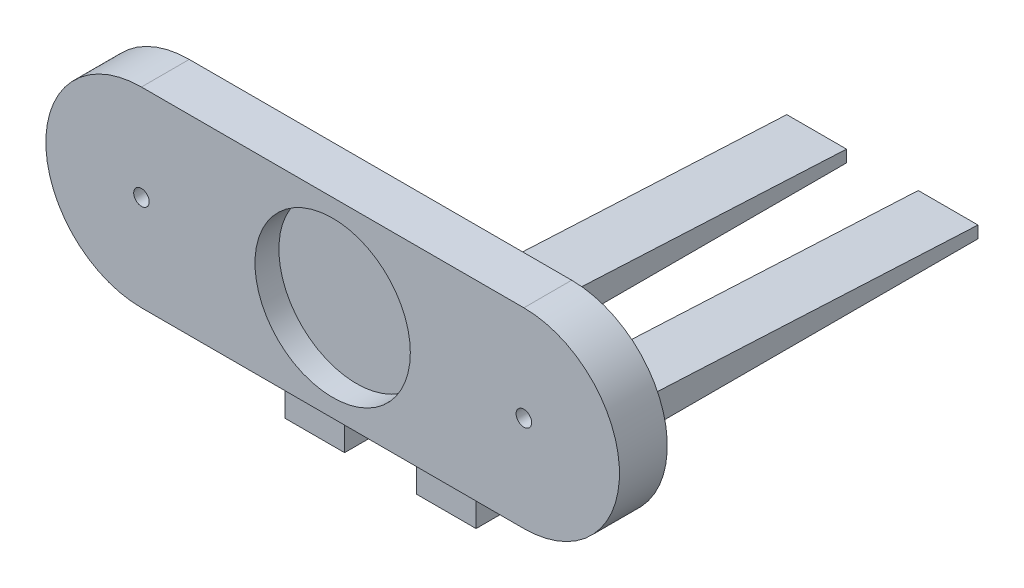
ISO-10303-21;
HEADER;
FILE_DESCRIPTION(('STEP AP214'),'2;1');
FILE_NAME('part.step','',(''),(''),'','','');
FILE_SCHEMA(('AUTOMOTIVE_DESIGN { 1 0 10303 214 1 1 1 1 }'));
ENDSEC;
DATA;
#1=APPLICATION_CONTEXT('core data for automotive mechanical design processes');
#2=APPLICATION_PROTOCOL_DEFINITION('international standard','automotive_design',2000,#1);
#3=PRODUCT_CONTEXT('',#1,'mechanical');
#4=PRODUCT('Part','Part','',(#3));
#5=PRODUCT_RELATED_PRODUCT_CATEGORY('part','',(#4));
#6=PRODUCT_DEFINITION_FORMATION('','',#4);
#7=PRODUCT_DEFINITION_CONTEXT('part definition',#1,'design');
#8=PRODUCT_DEFINITION('design','',#6,#7);
#9=PRODUCT_DEFINITION_SHAPE('','',#8);
#10=(LENGTH_UNIT() NAMED_UNIT(*) SI_UNIT(.MILLI.,.METRE.));
#11=(NAMED_UNIT(*) PLANE_ANGLE_UNIT() SI_UNIT($,.RADIAN.));
#12=(NAMED_UNIT(*) SI_UNIT($,.STERADIAN.) SOLID_ANGLE_UNIT());
#13=UNCERTAINTY_MEASURE_WITH_UNIT(LENGTH_MEASURE(1.E-05),#10,'distance_accuracy_value','');
#14=(GEOMETRIC_REPRESENTATION_CONTEXT(3) GLOBAL_UNCERTAINTY_ASSIGNED_CONTEXT((#13)) GLOBAL_UNIT_ASSIGNED_CONTEXT((#10,
#11,#12)) REPRESENTATION_CONTEXT('',''));
#15=CARTESIAN_POINT('',(0.,0.,0.));
#16=DIRECTION('',(0.,0.,1.));
#17=DIRECTION('',(1.,0.,0.));
#18=AXIS2_PLACEMENT_3D('',#15,#16,#17);
#19=CARTESIAN_POINT('',(-80.,0.,0.));
#20=DIRECTION('',(0.,0.,-1.));
#21=DIRECTION('',(-1.,0.,0.));
#22=AXIS2_PLACEMENT_3D('',#19,#20,#21);
#23=CYLINDRICAL_SURFACE('',#22,3.25000000000001);
#24=CARTESIAN_POINT('',(-80.,0.,0.));
#25=DIRECTION('',(0.,0.,-1.));
#26=DIRECTION('',(-1.,0.,0.));
#27=AXIS2_PLACEMENT_3D('',#24,#25,#26);
#28=CIRCLE('',#27,3.25000000000001);
#29=CARTESIAN_POINT('',(-83.25,0.,0.));
#30=VERTEX_POINT('',#29);
#31=EDGE_CURVE('E257',#30,#30,#28,.T.);
#32=ORIENTED_EDGE('',*,*,#31,.F.);
#33=EDGE_LOOP('',(#32));
#34=FACE_BOUND('',#33,.T.);
#35=CARTESIAN_POINT('',(-80.,0.,-10.));
#36=DIRECTION('',(0.,0.,-1.));
#37=DIRECTION('',(-1.,0.,0.));
#38=AXIS2_PLACEMENT_3D('',#35,#36,#37);
#39=CIRCLE('',#38,3.25000000000001);
#40=CARTESIAN_POINT('',(-83.25,0.,-10.));
#41=VERTEX_POINT('',#40);
#42=EDGE_CURVE('E39',#41,#41,#39,.F.);
#43=ORIENTED_EDGE('',*,*,#42,.F.);
#44=EDGE_LOOP('',(#43));
#45=FACE_BOUND('',#44,.T.);
#46=ADVANCED_FACE('F35',(#34,#45),#23,.F.);
#47=CARTESIAN_POINT('',(80.,0.,0.));
#48=DIRECTION('',(0.,0.,-1.));
#49=DIRECTION('',(-1.,0.,0.));
#50=AXIS2_PLACEMENT_3D('',#47,#48,#49);
#51=CYLINDRICAL_SURFACE('',#50,3.25000000000001);
#52=CARTESIAN_POINT('',(80.,0.,0.));
#53=DIRECTION('',(0.,0.,-1.));
#54=DIRECTION('',(-1.,0.,0.));
#55=AXIS2_PLACEMENT_3D('',#52,#53,#54);
#56=CIRCLE('',#55,3.25000000000001);
#57=CARTESIAN_POINT('',(76.75,0.,0.));
#58=VERTEX_POINT('',#57);
#59=EDGE_CURVE('E177',#58,#58,#56,.T.);
#60=ORIENTED_EDGE('',*,*,#59,.F.);
#61=EDGE_LOOP('',(#60));
#62=FACE_BOUND('',#61,.T.);
#63=CARTESIAN_POINT('',(80.,0.,-10.));
#64=DIRECTION('',(0.,0.,-1.));
#65=DIRECTION('',(-1.,0.,0.));
#66=AXIS2_PLACEMENT_3D('',#63,#64,#65);
#67=CIRCLE('',#66,3.25000000000001);
#68=CARTESIAN_POINT('',(76.75,0.,-10.));
#69=VERTEX_POINT('',#68);
#70=EDGE_CURVE('E255',#69,#69,#67,.F.);
#71=ORIENTED_EDGE('',*,*,#70,.F.);
#72=EDGE_LOOP('',(#71));
#73=FACE_BOUND('',#72,.T.);
#74=ADVANCED_FACE('F395',(#62,#73),#51,.F.);
#75=CARTESIAN_POINT('',(-80.,0.,-20.));
#76=DIRECTION('',(0.,0.,1.));
#77=DIRECTION('',(1.,0.,0.));
#78=AXIS2_PLACEMENT_3D('',#75,#76,#77);
#79=PLANE('',#78);
#80=CARTESIAN_POINT('',(-80.,0.,-20.));
#81=DIRECTION('',(0.,0.,-1.));
#82=DIRECTION('',(-1.,0.,0.));
#83=AXIS2_PLACEMENT_3D('',#80,#81,#82);
#84=CIRCLE('',#83,5.75);
#85=CARTESIAN_POINT('',(-85.75,0.,-20.));
#86=VERTEX_POINT('',#85);
#87=EDGE_CURVE('E271',#86,#86,#84,.T.);
#88=ORIENTED_EDGE('',*,*,#87,.F.);
#89=EDGE_LOOP('',(#88));
#90=FACE_BOUND('',#89,.T.);
#91=CARTESIAN_POINT('',(80.,0.,-20.));
#92=DIRECTION('',(0.,0.,-1.));
#93=DIRECTION('',(-1.,0.,0.));
#94=AXIS2_PLACEMENT_3D('',#91,#92,#93);
#95=CIRCLE('',#94,5.75);
#96=CARTESIAN_POINT('',(74.25,0.,-20.));
#97=VERTEX_POINT('',#96);
#98=EDGE_CURVE('E264',#97,#97,#95,.T.);
#99=ORIENTED_EDGE('',*,*,#98,.F.);
#100=EDGE_LOOP('',(#99));
#101=FACE_BOUND('',#100,.T.);
#102=DIRECTION('',(0.,-1.,0.));
#103=VECTOR('',#102,1.);
#104=CARTESIAN_POINT('',(-15.,7.5,-20.));
#105=LINE('',#104,#103);
#106=CARTESIAN_POINT('',(-15.,7.5,-20.));
#107=VERTEX_POINT('',#106);
#108=CARTESIAN_POINT('',(-15.,-40.,-20.));
#109=VERTEX_POINT('',#108);
#110=EDGE_CURVE('E308',#107,#109,#105,.T.);
#111=ORIENTED_EDGE('',*,*,#110,.F.);
#112=DIRECTION('',(1.,0.,0.));
#113=VECTOR('',#112,1.);
#114=CARTESIAN_POINT('',(-15.,7.5,-20.));
#115=LINE('',#114,#113);
#116=CARTESIAN_POINT('',(-40.,7.5,-20.));
#117=VERTEX_POINT('',#116);
#118=EDGE_CURVE('E303',#117,#107,#115,.T.);
#119=ORIENTED_EDGE('',*,*,#118,.F.);
#120=DIRECTION('',(0.,1.,0.));
#121=VECTOR('',#120,1.);
#122=CARTESIAN_POINT('',(-40.,7.5,-20.));
#123=LINE('',#122,#121);
#124=CARTESIAN_POINT('',(-40.,-40.,-20.));
#125=VERTEX_POINT('',#124);
#126=EDGE_CURVE('E312',#125,#117,#123,.T.);
#127=ORIENTED_EDGE('',*,*,#126,.F.);
#128=DIRECTION('',(1.,0.,0.));
#129=VECTOR('',#128,1.);
#130=CARTESIAN_POINT('',(-80.,-40.,-20.));
#131=LINE('',#130,#129);
#132=CARTESIAN_POINT('',(-80.,-40.,-20.));
#133=VERTEX_POINT('',#132);
#134=EDGE_CURVE('E226',#133,#125,#131,.T.);
#135=ORIENTED_EDGE('',*,*,#134,.F.);
#136=CARTESIAN_POINT('',(-80.,0.,-20.));
#137=DIRECTION('',(0.,0.,1.));
#138=DIRECTION('',(1.,0.,0.));
#139=AXIS2_PLACEMENT_3D('',#136,#137,#138);
#140=CIRCLE('',#139,40.);
#141=CARTESIAN_POINT('',(-80.,40.,-20.));
#142=VERTEX_POINT('',#141);
#143=EDGE_CURVE('E221',#142,#133,#140,.T.);
#144=ORIENTED_EDGE('',*,*,#143,.F.);
#145=DIRECTION('',(-1.,0.,0.));
#146=VECTOR('',#145,1.);
#147=CARTESIAN_POINT('',(-80.,40.,-20.));
#148=LINE('',#147,#146);
#149=CARTESIAN_POINT('',(80.,40.,-20.));
#150=VERTEX_POINT('',#149);
#151=EDGE_CURVE('E235',#150,#142,#148,.T.);
#152=ORIENTED_EDGE('',*,*,#151,.F.);
#153=CARTESIAN_POINT('',(80.,0.,-20.));
#154=DIRECTION('',(0.,0.,1.));
#155=DIRECTION('',(1.,0.,0.));
#156=AXIS2_PLACEMENT_3D('',#153,#154,#155);
#157=CIRCLE('',#156,40.);
#158=CARTESIAN_POINT('',(80.,-40.,-20.));
#159=VERTEX_POINT('',#158);
#160=EDGE_CURVE('E229',#159,#150,#157,.T.);
#161=ORIENTED_EDGE('',*,*,#160,.F.);
#162=CARTESIAN_POINT('',(40.,-40.,-20.));
#163=VERTEX_POINT('',#162);
#164=EDGE_CURVE('E224',#163,#159,#131,.T.);
#165=ORIENTED_EDGE('',*,*,#164,.F.);
#166=DIRECTION('',(0.,-1.,0.));
#167=VECTOR('',#166,1.);
#168=CARTESIAN_POINT('',(40.,7.5,-20.));
#169=LINE('',#168,#167);
#170=CARTESIAN_POINT('',(40.,7.5,-20.));
#171=VERTEX_POINT('',#170);
#172=EDGE_CURVE('E196',#171,#163,#169,.T.);
#173=ORIENTED_EDGE('',*,*,#172,.F.);
#174=DIRECTION('',(1.,0.,0.));
#175=VECTOR('',#174,1.);
#176=CARTESIAN_POINT('',(40.,7.5,-20.));
#177=LINE('',#176,#175);
#178=CARTESIAN_POINT('',(15.,7.5,-20.));
#179=VERTEX_POINT('',#178);
#180=EDGE_CURVE('E184',#179,#171,#177,.T.);
#181=ORIENTED_EDGE('',*,*,#180,.F.);
#182=DIRECTION('',(0.,1.,0.));
#183=VECTOR('',#182,1.);
#184=CARTESIAN_POINT('',(15.,7.5,-20.));
#185=LINE('',#184,#183);
#186=CARTESIAN_POINT('',(15.,-40.,-20.));
#187=VERTEX_POINT('',#186);
#188=EDGE_CURVE('E44',#187,#179,#185,.T.);
#189=ORIENTED_EDGE('',*,*,#188,.F.);
#190=EDGE_CURVE('E231',#109,#187,#131,.T.);
#191=ORIENTED_EDGE('',*,*,#190,.F.);
#192=EDGE_LOOP('',(#111,#119,#127,#135,#144,#152,#161,#165,#173,#181,#189,#191));
#193=FACE_BOUND('',#192,.T.);
#194=ADVANCED_FACE('F351',(#90,#101,#193),#79,.F.);
#195=CARTESIAN_POINT('',(-80.,0.,-20.));
#196=DIRECTION('',(0.,0.,1.));
#197=DIRECTION('',(1.,0.,0.));
#198=AXIS2_PLACEMENT_3D('',#195,#196,#197);
#199=CYLINDRICAL_SURFACE('',#198,40.);
#200=CARTESIAN_POINT('',(-80.,0.,0.));
#201=DIRECTION('',(0.,0.,1.));
#202=DIRECTION('',(1.,0.,0.));
#203=AXIS2_PLACEMENT_3D('',#200,#201,#202);
#204=CIRCLE('',#203,40.);
#205=CARTESIAN_POINT('',(-80.,40.,0.));
#206=VERTEX_POINT('',#205);
#207=CARTESIAN_POINT('',(-80.,-40.,0.));
#208=VERTEX_POINT('',#207);
#209=EDGE_CURVE('E218',#206,#208,#204,.T.);
#210=ORIENTED_EDGE('',*,*,#209,.F.);
#211=DIRECTION('',(0.,0.,1.));
#212=VECTOR('',#211,1.);
#213=CARTESIAN_POINT('',(-80.,40.,-20.));
#214=LINE('',#213,#212);
#215=EDGE_CURVE('E249',#142,#206,#214,.T.);
#216=ORIENTED_EDGE('',*,*,#215,.F.);
#217=ORIENTED_EDGE('',*,*,#143,.T.);
#218=DIRECTION('',(0.,0.,1.));
#219=VECTOR('',#218,1.);
#220=CARTESIAN_POINT('',(-80.,-40.,-20.));
#221=LINE('',#220,#219);
#222=EDGE_CURVE('E238',#133,#208,#221,.T.);
#223=ORIENTED_EDGE('',*,*,#222,.T.);
#224=EDGE_LOOP('',(#210,#216,#217,#223));
#225=FACE_BOUND('',#224,.T.);
#226=ADVANCED_FACE('F37',(#225),#199,.T.);
#227=CARTESIAN_POINT('',(-80.,40.,-20.));
#228=DIRECTION('',(0.,1.,0.));
#229=DIRECTION('',(-1.,0.,0.));
#230=AXIS2_PLACEMENT_3D('',#227,#228,#229);
#231=PLANE('',#230);
#232=DIRECTION('',(-1.,0.,0.));
#233=VECTOR('',#232,1.);
#234=CARTESIAN_POINT('',(-80.,40.,0.));
#235=LINE('',#234,#233);
#236=CARTESIAN_POINT('',(80.,40.,0.));
#237=VERTEX_POINT('',#236);
#238=EDGE_CURVE('E225',#237,#206,#235,.T.);
#239=ORIENTED_EDGE('',*,*,#238,.F.);
#240=DIRECTION('',(0.,0.,1.));
#241=VECTOR('',#240,1.);
#242=CARTESIAN_POINT('',(80.,40.,-20.));
#243=LINE('',#242,#241);
#244=EDGE_CURVE('E251',#150,#237,#243,.T.);
#245=ORIENTED_EDGE('',*,*,#244,.F.);
#246=ORIENTED_EDGE('',*,*,#151,.T.);
#247=ORIENTED_EDGE('',*,*,#215,.T.);
#248=EDGE_LOOP('',(#239,#245,#246,#247));
#249=FACE_BOUND('',#248,.T.);
#250=ADVANCED_FACE('F613',(#249),#231,.T.);
#251=CARTESIAN_POINT('',(80.,0.,-20.));
#252=DIRECTION('',(0.,0.,1.));
#253=DIRECTION('',(1.,0.,0.));
#254=AXIS2_PLACEMENT_3D('',#251,#252,#253);
#255=CYLINDRICAL_SURFACE('',#254,40.);
#256=CARTESIAN_POINT('',(80.,0.,0.));
#257=DIRECTION('',(0.,0.,1.));
#258=DIRECTION('',(1.,0.,0.));
#259=AXIS2_PLACEMENT_3D('',#256,#257,#258);
#260=CIRCLE('',#259,40.);
#261=CARTESIAN_POINT('',(80.,-40.,0.));
#262=VERTEX_POINT('',#261);
#263=EDGE_CURVE('E244',#262,#237,#260,.T.);
#264=ORIENTED_EDGE('',*,*,#263,.F.);
#265=DIRECTION('',(0.,0.,1.));
#266=VECTOR('',#265,1.);
#267=CARTESIAN_POINT('',(80.,-40.,-20.));
#268=LINE('',#267,#266);
#269=EDGE_CURVE('E253',#159,#262,#268,.T.);
#270=ORIENTED_EDGE('',*,*,#269,.F.);
#271=ORIENTED_EDGE('',*,*,#160,.T.);
#272=ORIENTED_EDGE('',*,*,#244,.T.);
#273=EDGE_LOOP('',(#264,#270,#271,#272));
#274=FACE_BOUND('',#273,.T.);
#275=ADVANCED_FACE('F616',(#274),#255,.T.);
#276=CARTESIAN_POINT('',(-80.,-40.,-20.));
#277=DIRECTION('',(0.,-1.,0.));
#278=DIRECTION('',(1.,0.,0.));
#279=AXIS2_PLACEMENT_3D('',#276,#277,#278);
#280=PLANE('',#279);
#281=DIRECTION('',(1.,0.,0.));
#282=VECTOR('',#281,1.);
#283=CARTESIAN_POINT('',(-80.,-40.,0.));
#284=LINE('',#283,#282);
#285=EDGE_CURVE('E241',#208,#262,#284,.T.);
#286=ORIENTED_EDGE('',*,*,#285,.F.);
#287=ORIENTED_EDGE('',*,*,#222,.F.);
#288=ORIENTED_EDGE('',*,*,#134,.T.);
#289=EDGE_CURVE('E230',#125,#109,#131,.T.);
#290=ORIENTED_EDGE('',*,*,#289,.T.);
#291=ORIENTED_EDGE('',*,*,#190,.T.);
#292=EDGE_CURVE('E232',#187,#163,#131,.T.);
#293=ORIENTED_EDGE('',*,*,#292,.T.);
#294=ORIENTED_EDGE('',*,*,#164,.T.);
#295=ORIENTED_EDGE('',*,*,#269,.T.);
#296=EDGE_LOOP('',(#286,#287,#288,#290,#291,#293,#294,#295));
#297=FACE_BOUND('',#296,.T.);
#298=ADVANCED_FACE('F359',(#297),#280,.T.);
#299=CARTESIAN_POINT('',(-80.,0.,0.));
#300=DIRECTION('',(0.,0.,1.));
#301=DIRECTION('',(1.,0.,0.));
#302=AXIS2_PLACEMENT_3D('',#299,#300,#301);
#303=PLANE('',#302);
#304=ORIENTED_EDGE('',*,*,#31,.T.);
#305=EDGE_LOOP('',(#304));
#306=FACE_BOUND('',#305,.T.);
#307=ORIENTED_EDGE('',*,*,#59,.T.);
#308=EDGE_LOOP('',(#307));
#309=FACE_BOUND('',#308,.T.);
#310=CARTESIAN_POINT('',(0.,0.,0.));
#311=DIRECTION('',(0.,0.,1.));
#312=DIRECTION('',(1.,0.,0.));
#313=AXIS2_PLACEMENT_3D('',#310,#311,#312);
#314=CIRCLE('',#313,32.5);
#315=CARTESIAN_POINT('',(32.5,0.,0.));
#316=VERTEX_POINT('',#315);
#317=EDGE_CURVE('E214',#316,#316,#314,.T.);
#318=ORIENTED_EDGE('',*,*,#317,.F.);
#319=EDGE_LOOP('',(#318));
#320=FACE_BOUND('',#319,.T.);
#321=ORIENTED_EDGE('',*,*,#209,.T.);
#322=ORIENTED_EDGE('',*,*,#285,.T.);
#323=ORIENTED_EDGE('',*,*,#263,.T.);
#324=ORIENTED_EDGE('',*,*,#238,.T.);
#325=EDGE_LOOP('',(#321,#322,#323,#324));
#326=FACE_BOUND('',#325,.T.);
#327=ADVANCED_FACE('F605',(#306,#309,#320,#326),#303,.T.);
#328=CARTESIAN_POINT('',(0.,0.,-10.));
#329=DIRECTION('',(0.,0.,1.));
#330=DIRECTION('',(1.,0.,0.));
#331=AXIS2_PLACEMENT_3D('',#328,#329,#330);
#332=CYLINDRICAL_SURFACE('',#331,32.5);
#333=CARTESIAN_POINT('',(0.,0.,-10.));
#334=DIRECTION('',(0.,0.,1.));
#335=DIRECTION('',(1.,0.,0.));
#336=AXIS2_PLACEMENT_3D('',#333,#334,#335);
#337=CIRCLE('',#336,32.5);
#338=CARTESIAN_POINT('',(32.5,0.,-10.));
#339=VERTEX_POINT('',#338);
#340=EDGE_CURVE('E215',#339,#339,#337,.T.);
#341=ORIENTED_EDGE('',*,*,#340,.F.);
#342=EDGE_LOOP('',(#341));
#343=FACE_BOUND('',#342,.T.);
#344=ORIENTED_EDGE('',*,*,#317,.T.);
#345=EDGE_LOOP('',(#344));
#346=FACE_BOUND('',#345,.T.);
#347=ADVANCED_FACE('F602',(#343,#346),#332,.F.);
#348=CARTESIAN_POINT('',(0.,0.,-10.));
#349=DIRECTION('',(0.,0.,1.));
#350=DIRECTION('',(1.,0.,0.));
#351=AXIS2_PLACEMENT_3D('',#348,#349,#350);
#352=PLANE('',#351);
#353=ORIENTED_EDGE('',*,*,#340,.T.);
#354=EDGE_LOOP('',(#353));
#355=FACE_BOUND('',#354,.T.);
#356=ADVANCED_FACE('F559',(#355),#352,.T.);
#357=CARTESIAN_POINT('',(40.,7.5,-30.));
#358=DIRECTION('',(-1.,0.,0.));
#359=DIRECTION('',(0.,-1.,0.));
#360=AXIS2_PLACEMENT_3D('',#357,#358,#359);
#361=PLANE('',#360);
#362=DIRECTION('',(0.,-1.,0.));
#363=VECTOR('',#362,1.);
#364=CARTESIAN_POINT('',(40.,-70.,-230.));
#365=LINE('',#364,#363);
#366=CARTESIAN_POINT('',(40.,-65.,-230.));
#367=VERTEX_POINT('',#366);
#368=CARTESIAN_POINT('',(40.,-70.,-230.));
#369=VERTEX_POINT('',#368);
#370=EDGE_CURVE('E166',#367,#369,#365,.T.);
#371=ORIENTED_EDGE('',*,*,#370,.F.);
#372=DIRECTION('',(0.,-0.0499376169438922,-0.998752338877845));
#373=VECTOR('',#372,1.);
#374=CARTESIAN_POINT('',(40.,-55.,-30.));
#375=LINE('',#374,#373);
#376=CARTESIAN_POINT('',(40.,-55.,-30.));
#377=VERTEX_POINT('',#376);
#378=EDGE_CURVE('E52',#377,#367,#375,.T.);
#379=ORIENTED_EDGE('',*,*,#378,.F.);
#380=DIRECTION('',(0.,-1.,0.));
#381=VECTOR('',#380,1.);
#382=CARTESIAN_POINT('',(40.,7.5,-30.));
#383=LINE('',#382,#381);
#384=CARTESIAN_POINT('',(40.,7.5,-30.));
#385=VERTEX_POINT('',#384);
#386=EDGE_CURVE('E174',#385,#377,#383,.T.);
#387=ORIENTED_EDGE('',*,*,#386,.F.);
#388=DIRECTION('',(0.,0.,1.));
#389=VECTOR('',#388,1.);
#390=CARTESIAN_POINT('',(40.,7.5,-30.));
#391=LINE('',#390,#389);
#392=EDGE_CURVE('E195',#385,#171,#391,.T.);
#393=ORIENTED_EDGE('',*,*,#392,.T.);
#394=ORIENTED_EDGE('',*,*,#172,.T.);
#395=CARTESIAN_POINT('',(40.,-70.,-20.));
#396=VERTEX_POINT('',#395);
#397=EDGE_CURVE('E200',#163,#396,#169,.T.);
#398=ORIENTED_EDGE('',*,*,#397,.T.);
#399=DIRECTION('',(0.,0.,1.));
#400=VECTOR('',#399,1.);
#401=CARTESIAN_POINT('',(40.,-70.,-30.));
#402=LINE('',#401,#400);
#403=EDGE_CURVE('E211',#369,#396,#402,.T.);
#404=ORIENTED_EDGE('',*,*,#403,.F.);
#405=EDGE_LOOP('',(#371,#379,#387,#393,#394,#398,#404));
#406=FACE_BOUND('',#405,.T.);
#407=ADVANCED_FACE('F172',(#406),#361,.F.);
#408=CARTESIAN_POINT('',(40.,-70.,-30.));
#409=DIRECTION('',(0.,1.,0.));
#410=DIRECTION('',(0.,0.,1.));
#411=AXIS2_PLACEMENT_3D('',#408,#409,#410);
#412=PLANE('',#411);
#413=DIRECTION('',(-1.,0.,0.));
#414=VECTOR('',#413,1.);
#415=CARTESIAN_POINT('',(40.,-70.,-20.));
#416=LINE('',#415,#414);
#417=CARTESIAN_POINT('',(15.,-70.,-20.));
#418=VERTEX_POINT('',#417);
#419=EDGE_CURVE('E199',#396,#418,#416,.T.);
#420=ORIENTED_EDGE('',*,*,#419,.T.);
#421=DIRECTION('',(0.,0.,1.));
#422=VECTOR('',#421,1.);
#423=CARTESIAN_POINT('',(15.,-70.,-30.));
#424=LINE('',#423,#422);
#425=CARTESIAN_POINT('',(15.,-70.,-230.));
#426=VERTEX_POINT('',#425);
#427=EDGE_CURVE('E208',#426,#418,#424,.T.);
#428=ORIENTED_EDGE('',*,*,#427,.F.);
#429=DIRECTION('',(-1.,0.,0.));
#430=VECTOR('',#429,1.);
#431=CARTESIAN_POINT('',(40.,-70.,-230.));
#432=LINE('',#431,#430);
#433=EDGE_CURVE('E292',#369,#426,#432,.T.);
#434=ORIENTED_EDGE('',*,*,#433,.F.);
#435=ORIENTED_EDGE('',*,*,#403,.T.);
#436=EDGE_LOOP('',(#420,#428,#434,#435));
#437=FACE_BOUND('',#436,.T.);
#438=ADVANCED_FACE('F338',(#437),#412,.F.);
#439=CARTESIAN_POINT('',(15.,7.5,-30.));
#440=DIRECTION('',(1.,0.,0.));
#441=DIRECTION('',(0.,1.,0.));
#442=AXIS2_PLACEMENT_3D('',#439,#440,#441);
#443=PLANE('',#442);
#444=DIRECTION('',(0.,1.,0.));
#445=VECTOR('',#444,1.);
#446=CARTESIAN_POINT('',(15.,7.5,-30.));
#447=LINE('',#446,#445);
#448=CARTESIAN_POINT('',(15.,-55.,-30.));
#449=VERTEX_POINT('',#448);
#450=CARTESIAN_POINT('',(15.,7.5,-30.));
#451=VERTEX_POINT('',#450);
#452=EDGE_CURVE('E183',#449,#451,#447,.T.);
#453=ORIENTED_EDGE('',*,*,#452,.F.);
#454=DIRECTION('',(0.,-0.0499376169438922,-0.998752338877845));
#455=VECTOR('',#454,1.);
#456=CARTESIAN_POINT('',(15.,-54.8441396508728,-26.8827930174564));
#457=LINE('',#456,#455);
#458=CARTESIAN_POINT('',(15.,-65.,-230.));
#459=VERTEX_POINT('',#458);
#460=EDGE_CURVE('E162',#449,#459,#457,.T.);
#461=ORIENTED_EDGE('',*,*,#460,.T.);
#462=DIRECTION('',(0.,1.,0.));
#463=VECTOR('',#462,1.);
#464=CARTESIAN_POINT('',(15.,-70.,-230.));
#465=LINE('',#464,#463);
#466=EDGE_CURVE('E295',#426,#459,#465,.T.);
#467=ORIENTED_EDGE('',*,*,#466,.F.);
#468=ORIENTED_EDGE('',*,*,#427,.T.);
#469=EDGE_CURVE('E188',#418,#187,#185,.T.);
#470=ORIENTED_EDGE('',*,*,#469,.T.);
#471=ORIENTED_EDGE('',*,*,#188,.T.);
#472=DIRECTION('',(0.,0.,1.));
#473=VECTOR('',#472,1.);
#474=CARTESIAN_POINT('',(15.,7.5,-30.));
#475=LINE('',#474,#473);
#476=EDGE_CURVE('E205',#451,#179,#475,.T.);
#477=ORIENTED_EDGE('',*,*,#476,.F.);
#478=EDGE_LOOP('',(#453,#461,#467,#468,#470,#471,#477));
#479=FACE_BOUND('',#478,.T.);
#480=ADVANCED_FACE('F343',(#479),#443,.F.);
#481=CARTESIAN_POINT('',(40.,7.5,-30.));
#482=DIRECTION('',(0.,-1.,0.));
#483=DIRECTION('',(1.,0.,0.));
#484=AXIS2_PLACEMENT_3D('',#481,#482,#483);
#485=PLANE('',#484);
#486=ORIENTED_EDGE('',*,*,#180,.T.);
#487=ORIENTED_EDGE('',*,*,#392,.F.);
#488=DIRECTION('',(1.,0.,0.));
#489=VECTOR('',#488,1.);
#490=CARTESIAN_POINT('',(40.,7.5,-30.));
#491=LINE('',#490,#489);
#492=EDGE_CURVE('E181',#451,#385,#491,.T.);
#493=ORIENTED_EDGE('',*,*,#492,.F.);
#494=ORIENTED_EDGE('',*,*,#476,.T.);
#495=EDGE_LOOP('',(#486,#487,#493,#494));
#496=FACE_BOUND('',#495,.T.);
#497=ADVANCED_FACE('F348',(#496),#485,.F.);
#498=CARTESIAN_POINT('',(0.,0.,-30.));
#499=DIRECTION('',(0.,0.,-1.));
#500=DIRECTION('',(-1.,0.,0.));
#501=AXIS2_PLACEMENT_3D('',#498,#499,#500);
#502=PLANE('',#501);
#503=DIRECTION('',(1.,0.,0.));
#504=VECTOR('',#503,1.);
#505=CARTESIAN_POINT('',(40.,-55.,-30.));
#506=LINE('',#505,#504);
#507=EDGE_CURVE('E159',#449,#377,#506,.T.);
#508=ORIENTED_EDGE('',*,*,#507,.F.);
#509=ORIENTED_EDGE('',*,*,#452,.T.);
#510=ORIENTED_EDGE('',*,*,#492,.T.);
#511=ORIENTED_EDGE('',*,*,#386,.T.);
#512=EDGE_LOOP('',(#508,#509,#510,#511));
#513=FACE_BOUND('',#512,.T.);
#514=ADVANCED_FACE('F179',(#513),#502,.T.);
#515=CARTESIAN_POINT('',(0.,0.,-20.));
#516=DIRECTION('',(0.,0.,-1.));
#517=DIRECTION('',(-1.,0.,0.));
#518=AXIS2_PLACEMENT_3D('',#515,#516,#517);
#519=PLANE('',#518);
#520=ORIENTED_EDGE('',*,*,#292,.F.);
#521=ORIENTED_EDGE('',*,*,#469,.F.);
#522=ORIENTED_EDGE('',*,*,#419,.F.);
#523=ORIENTED_EDGE('',*,*,#397,.F.);
#524=EDGE_LOOP('',(#520,#521,#522,#523));
#525=FACE_BOUND('',#524,.T.);
#526=ADVANCED_FACE('F336',(#525),#519,.F.);
#527=CARTESIAN_POINT('',(-15.,7.5,-30.));
#528=DIRECTION('',(-1.,0.,0.));
#529=DIRECTION('',(0.,-1.,0.));
#530=AXIS2_PLACEMENT_3D('',#527,#528,#529);
#531=PLANE('',#530);
#532=DIRECTION('',(0.,-1.,0.));
#533=VECTOR('',#532,1.);
#534=CARTESIAN_POINT('',(-15.,-70.,-230.));
#535=LINE('',#534,#533);
#536=CARTESIAN_POINT('',(-15.,-65.,-230.));
#537=VERTEX_POINT('',#536);
#538=CARTESIAN_POINT('',(-15.,-70.,-230.));
#539=VERTEX_POINT('',#538);
#540=EDGE_CURVE('E283',#537,#539,#535,.T.);
#541=ORIENTED_EDGE('',*,*,#540,.F.);
#542=DIRECTION('',(0.,0.0499376169438922,0.998752338877845));
#543=VECTOR('',#542,1.);
#544=CARTESIAN_POINT('',(-15.,-54.8441396508728,-26.8827930174564));
#545=LINE('',#544,#543);
#546=CARTESIAN_POINT('',(-15.,-55.,-30.));
#547=VERTEX_POINT('',#546);
#548=EDGE_CURVE('E60',#537,#547,#545,.T.);
#549=ORIENTED_EDGE('',*,*,#548,.T.);
#550=DIRECTION('',(0.,-1.,0.));
#551=VECTOR('',#550,1.);
#552=CARTESIAN_POINT('',(-15.,7.5,-30.));
#553=LINE('',#552,#551);
#554=CARTESIAN_POINT('',(-15.,7.5,-30.));
#555=VERTEX_POINT('',#554);
#556=EDGE_CURVE('E299',#555,#547,#553,.T.);
#557=ORIENTED_EDGE('',*,*,#556,.F.);
#558=DIRECTION('',(0.,0.,1.));
#559=VECTOR('',#558,1.);
#560=CARTESIAN_POINT('',(-15.,7.5,-30.));
#561=LINE('',#560,#559);
#562=EDGE_CURVE('E307',#555,#107,#561,.T.);
#563=ORIENTED_EDGE('',*,*,#562,.T.);
#564=ORIENTED_EDGE('',*,*,#110,.T.);
#565=CARTESIAN_POINT('',(-15.,-70.,-20.));
#566=VERTEX_POINT('',#565);
#567=EDGE_CURVE('E297',#109,#566,#105,.T.);
#568=ORIENTED_EDGE('',*,*,#567,.T.);
#569=DIRECTION('',(0.,0.,1.));
#570=VECTOR('',#569,1.);
#571=CARTESIAN_POINT('',(-15.,-70.,-30.));
#572=LINE('',#571,#570);
#573=EDGE_CURVE('E191',#539,#566,#572,.T.);
#574=ORIENTED_EDGE('',*,*,#573,.F.);
#575=EDGE_LOOP('',(#541,#549,#557,#563,#564,#568,#574));
#576=FACE_BOUND('',#575,.T.);
#577=ADVANCED_FACE('F379',(#576),#531,.F.);
#578=CARTESIAN_POINT('',(-15.,-70.,-30.));
#579=DIRECTION('',(0.,1.,0.));
#580=DIRECTION('',(0.,0.,1.));
#581=AXIS2_PLACEMENT_3D('',#578,#579,#580);
#582=PLANE('',#581);
#583=DIRECTION('',(-1.,0.,0.));
#584=VECTOR('',#583,1.);
#585=CARTESIAN_POINT('',(-15.,-70.,-20.));
#586=LINE('',#585,#584);
#587=CARTESIAN_POINT('',(-40.,-70.,-20.));
#588=VERTEX_POINT('',#587);
#589=EDGE_CURVE('E310',#566,#588,#586,.T.);
#590=ORIENTED_EDGE('',*,*,#589,.T.);
#591=DIRECTION('',(0.,0.,1.));
#592=VECTOR('',#591,1.);
#593=CARTESIAN_POINT('',(-40.,-70.,-30.));
#594=LINE('',#593,#592);
#595=CARTESIAN_POINT('',(-40.,-70.,-230.));
#596=VERTEX_POINT('',#595);
#597=EDGE_CURVE('E321',#596,#588,#594,.T.);
#598=ORIENTED_EDGE('',*,*,#597,.F.);
#599=DIRECTION('',(-1.,0.,0.));
#600=VECTOR('',#599,1.);
#601=CARTESIAN_POINT('',(-15.,-70.,-230.));
#602=LINE('',#601,#600);
#603=EDGE_CURVE('E285',#539,#596,#602,.T.);
#604=ORIENTED_EDGE('',*,*,#603,.F.);
#605=ORIENTED_EDGE('',*,*,#573,.T.);
#606=EDGE_LOOP('',(#590,#598,#604,#605));
#607=FACE_BOUND('',#606,.T.);
#608=ADVANCED_FACE('F385',(#607),#582,.F.);
#609=CARTESIAN_POINT('',(-40.,7.5,-30.));
#610=DIRECTION('',(1.,0.,0.));
#611=DIRECTION('',(0.,1.,0.));
#612=AXIS2_PLACEMENT_3D('',#609,#610,#611);
#613=PLANE('',#612);
#614=DIRECTION('',(0.,1.,0.));
#615=VECTOR('',#614,1.);
#616=CARTESIAN_POINT('',(-40.,7.5,-30.));
#617=LINE('',#616,#615);
#618=CARTESIAN_POINT('',(-40.,-55.,-30.));
#619=VERTEX_POINT('',#618);
#620=CARTESIAN_POINT('',(-40.,7.5,-30.));
#621=VERTEX_POINT('',#620);
#622=EDGE_CURVE('E302',#619,#621,#617,.T.);
#623=ORIENTED_EDGE('',*,*,#622,.F.);
#624=DIRECTION('',(0.,-0.0499376169438922,-0.998752338877845));
#625=VECTOR('',#624,1.);
#626=CARTESIAN_POINT('',(-40.,-54.8441396508728,-26.8827930174564));
#627=LINE('',#626,#625);
#628=CARTESIAN_POINT('',(-40.,-65.,-230.));
#629=VERTEX_POINT('',#628);
#630=EDGE_CURVE('E277',#619,#629,#627,.T.);
#631=ORIENTED_EDGE('',*,*,#630,.T.);
#632=DIRECTION('',(0.,1.,0.));
#633=VECTOR('',#632,1.);
#634=CARTESIAN_POINT('',(-40.,-70.,-230.));
#635=LINE('',#634,#633);
#636=EDGE_CURVE('E167',#596,#629,#635,.T.);
#637=ORIENTED_EDGE('',*,*,#636,.F.);
#638=ORIENTED_EDGE('',*,*,#597,.T.);
#639=EDGE_CURVE('E313',#588,#125,#123,.T.);
#640=ORIENTED_EDGE('',*,*,#639,.T.);
#641=ORIENTED_EDGE('',*,*,#126,.T.);
#642=DIRECTION('',(0.,0.,1.));
#643=VECTOR('',#642,1.);
#644=CARTESIAN_POINT('',(-40.,7.5,-30.));
#645=LINE('',#644,#643);
#646=EDGE_CURVE('E319',#621,#117,#645,.T.);
#647=ORIENTED_EDGE('',*,*,#646,.F.);
#648=EDGE_LOOP('',(#623,#631,#637,#638,#640,#641,#647));
#649=FACE_BOUND('',#648,.T.);
#650=ADVANCED_FACE('F368',(#649),#613,.F.);
#651=CARTESIAN_POINT('',(-15.,7.5,-30.));
#652=DIRECTION('',(0.,-1.,0.));
#653=DIRECTION('',(1.,0.,0.));
#654=AXIS2_PLACEMENT_3D('',#651,#652,#653);
#655=PLANE('',#654);
#656=ORIENTED_EDGE('',*,*,#118,.T.);
#657=ORIENTED_EDGE('',*,*,#562,.F.);
#658=DIRECTION('',(1.,0.,0.));
#659=VECTOR('',#658,1.);
#660=CARTESIAN_POINT('',(-15.,7.5,-30.));
#661=LINE('',#660,#659);
#662=EDGE_CURVE('E305',#621,#555,#661,.T.);
#663=ORIENTED_EDGE('',*,*,#662,.F.);
#664=ORIENTED_EDGE('',*,*,#646,.T.);
#665=EDGE_LOOP('',(#656,#657,#663,#664));
#666=FACE_BOUND('',#665,.T.);
#667=ADVANCED_FACE('F374',(#666),#655,.F.);
#668=CARTESIAN_POINT('',(0.,0.,-30.));
#669=DIRECTION('',(0.,0.,-1.));
#670=DIRECTION('',(-1.,0.,0.));
#671=AXIS2_PLACEMENT_3D('',#668,#669,#670);
#672=PLANE('',#671);
#673=DIRECTION('',(1.,0.,0.));
#674=VECTOR('',#673,1.);
#675=CARTESIAN_POINT('',(-15.,-55.,-30.));
#676=LINE('',#675,#674);
#677=EDGE_CURVE('E282',#619,#547,#676,.T.);
#678=ORIENTED_EDGE('',*,*,#677,.F.);
#679=ORIENTED_EDGE('',*,*,#622,.T.);
#680=ORIENTED_EDGE('',*,*,#662,.T.);
#681=ORIENTED_EDGE('',*,*,#556,.T.);
#682=EDGE_LOOP('',(#678,#679,#680,#681));
#683=FACE_BOUND('',#682,.T.);
#684=ADVANCED_FACE('F382',(#683),#672,.T.);
#685=CARTESIAN_POINT('',(0.,0.,-20.));
#686=DIRECTION('',(0.,0.,-1.));
#687=DIRECTION('',(-1.,0.,0.));
#688=AXIS2_PLACEMENT_3D('',#685,#686,#687);
#689=PLANE('',#688);
#690=ORIENTED_EDGE('',*,*,#289,.F.);
#691=ORIENTED_EDGE('',*,*,#639,.F.);
#692=ORIENTED_EDGE('',*,*,#589,.F.);
#693=ORIENTED_EDGE('',*,*,#567,.F.);
#694=EDGE_LOOP('',(#690,#691,#692,#693));
#695=FACE_BOUND('',#694,.T.);
#696=ADVANCED_FACE('F364',(#695),#689,.F.);
#697=CARTESIAN_POINT('',(0.,0.,-230.));
#698=DIRECTION('',(0.,0.,1.));
#699=DIRECTION('',(1.,0.,0.));
#700=AXIS2_PLACEMENT_3D('',#697,#698,#699);
#701=PLANE('',#700);
#702=ORIENTED_EDGE('',*,*,#466,.T.);
#703=DIRECTION('',(1.,0.,0.));
#704=VECTOR('',#703,1.);
#705=CARTESIAN_POINT('',(-120.,-65.,-230.));
#706=LINE('',#705,#704);
#707=EDGE_CURVE('E176',#459,#367,#706,.T.);
#708=ORIENTED_EDGE('',*,*,#707,.T.);
#709=ORIENTED_EDGE('',*,*,#370,.T.);
#710=ORIENTED_EDGE('',*,*,#433,.T.);
#711=EDGE_LOOP('',(#702,#708,#709,#710));
#712=FACE_BOUND('',#711,.T.);
#713=ADVANCED_FACE('F341',(#712),#701,.F.);
#714=CARTESIAN_POINT('',(0.,0.,-230.));
#715=DIRECTION('',(0.,0.,1.));
#716=DIRECTION('',(1.,0.,0.));
#717=AXIS2_PLACEMENT_3D('',#714,#715,#716);
#718=PLANE('',#717);
#719=ORIENTED_EDGE('',*,*,#636,.T.);
#720=DIRECTION('',(1.,0.,0.));
#721=VECTOR('',#720,1.);
#722=CARTESIAN_POINT('',(0.,-65.,-230.));
#723=LINE('',#722,#721);
#724=EDGE_CURVE('E11',#629,#537,#723,.T.);
#725=ORIENTED_EDGE('',*,*,#724,.T.);
#726=ORIENTED_EDGE('',*,*,#540,.T.);
#727=ORIENTED_EDGE('',*,*,#603,.T.);
#728=EDGE_LOOP('',(#719,#725,#726,#727));
#729=FACE_BOUND('',#728,.T.);
#730=ADVANCED_FACE('F384',(#729),#718,.F.);
#731=CARTESIAN_POINT('',(-120.,-55.,-30.));
#732=DIRECTION('',(0.,-0.998752338877845,0.0499376169438922));
#733=DIRECTION('',(0.,-0.0499376169438922,-0.998752338877845));
#734=AXIS2_PLACEMENT_3D('',#731,#732,#733);
#735=PLANE('',#734);
#736=ORIENTED_EDGE('',*,*,#724,.F.);
#737=ORIENTED_EDGE('',*,*,#630,.F.);
#738=ORIENTED_EDGE('',*,*,#677,.T.);
#739=ORIENTED_EDGE('',*,*,#548,.F.);
#740=EDGE_LOOP('',(#736,#737,#738,#739));
#741=FACE_BOUND('',#740,.T.);
#742=ADVANCED_FACE('F412',(#741),#735,.F.);
#743=ORIENTED_EDGE('',*,*,#507,.T.);
#744=ORIENTED_EDGE('',*,*,#378,.T.);
#745=ORIENTED_EDGE('',*,*,#707,.F.);
#746=ORIENTED_EDGE('',*,*,#460,.F.);
#747=EDGE_LOOP('',(#743,#744,#745,#746));
#748=FACE_BOUND('',#747,.T.);
#749=ADVANCED_FACE('F160',(#748),#735,.F.);
#750=CARTESIAN_POINT('',(80.,0.,-10.));
#751=DIRECTION('',(0.,0.,-1.));
#752=DIRECTION('',(-1.,0.,0.));
#753=AXIS2_PLACEMENT_3D('',#750,#751,#752);
#754=PLANE('',#753);
#755=CARTESIAN_POINT('',(80.,0.,-10.));
#756=DIRECTION('',(0.,0.,-1.));
#757=DIRECTION('',(-1.,0.,0.));
#758=AXIS2_PLACEMENT_3D('',#755,#756,#757);
#759=CIRCLE('',#758,5.75);
#760=CARTESIAN_POINT('',(74.25,0.,-10.));
#761=VERTEX_POINT('',#760);
#762=EDGE_CURVE('E258',#761,#761,#759,.T.);
#763=ORIENTED_EDGE('',*,*,#762,.T.);
#764=EDGE_LOOP('',(#763));
#765=FACE_BOUND('',#764,.T.);
#766=ORIENTED_EDGE('',*,*,#70,.T.);
#767=EDGE_LOOP('',(#766));
#768=FACE_BOUND('',#767,.T.);
#769=ADVANCED_FACE('F411',(#765,#768),#754,.T.);
#770=CARTESIAN_POINT('',(80.,0.,-10.));
#771=DIRECTION('',(0.,0.,-1.));
#772=DIRECTION('',(-1.,0.,0.));
#773=AXIS2_PLACEMENT_3D('',#770,#771,#772);
#774=CYLINDRICAL_SURFACE('',#773,5.75);
#775=ORIENTED_EDGE('',*,*,#762,.F.);
#776=EDGE_LOOP('',(#775));
#777=FACE_BOUND('',#776,.T.);
#778=ORIENTED_EDGE('',*,*,#98,.T.);
#779=EDGE_LOOP('',(#778));
#780=FACE_BOUND('',#779,.T.);
#781=ADVANCED_FACE('F406',(#777,#780),#774,.F.);
#782=CARTESIAN_POINT('',(-80.,0.,-10.));
#783=DIRECTION('',(0.,0.,-1.));
#784=DIRECTION('',(-1.,0.,0.));
#785=AXIS2_PLACEMENT_3D('',#782,#783,#784);
#786=PLANE('',#785);
#787=CARTESIAN_POINT('',(-80.,0.,-10.));
#788=DIRECTION('',(0.,0.,-1.));
#789=DIRECTION('',(-1.,0.,0.));
#790=AXIS2_PLACEMENT_3D('',#787,#788,#789);
#791=CIRCLE('',#790,5.75);
#792=CARTESIAN_POINT('',(-85.75,0.,-10.));
#793=VERTEX_POINT('',#792);
#794=EDGE_CURVE('E682',#793,#793,#791,.T.);
#795=ORIENTED_EDGE('',*,*,#794,.T.);
#796=EDGE_LOOP('',(#795));
#797=FACE_BOUND('',#796,.T.);
#798=ORIENTED_EDGE('',*,*,#42,.T.);
#799=EDGE_LOOP('',(#798));
#800=FACE_BOUND('',#799,.T.);
#801=ADVANCED_FACE('F466',(#797,#800),#786,.T.);
#802=CARTESIAN_POINT('',(-80.,0.,-10.));
#803=DIRECTION('',(0.,0.,-1.));
#804=DIRECTION('',(-1.,0.,0.));
#805=AXIS2_PLACEMENT_3D('',#802,#803,#804);
#806=CYLINDRICAL_SURFACE('',#805,5.75);
#807=ORIENTED_EDGE('',*,*,#794,.F.);
#808=EDGE_LOOP('',(#807));
#809=FACE_BOUND('',#808,.T.);
#810=ORIENTED_EDGE('',*,*,#87,.T.);
#811=EDGE_LOOP('',(#810));
#812=FACE_BOUND('',#811,.T.);
#813=ADVANCED_FACE('F473',(#809,#812),#806,.F.);
#814=CLOSED_SHELL('',(#46,#74,#194,#226,#250,#275,#298,#327,#347,#356,#407,#438,#480,#497,#514,
#526,#577,#608,#650,#667,#684,#696,#713,#730,#742,#749,#769,#781,#801,#813));
#815=MANIFOLD_SOLID_BREP('B2',#814);
#816=ADVANCED_BREP_SHAPE_REPRESENTATION('',(#18,#815),#14);
#817=SHAPE_DEFINITION_REPRESENTATION(#9,#816);
ENDSEC;
END-ISO-10303-21;
